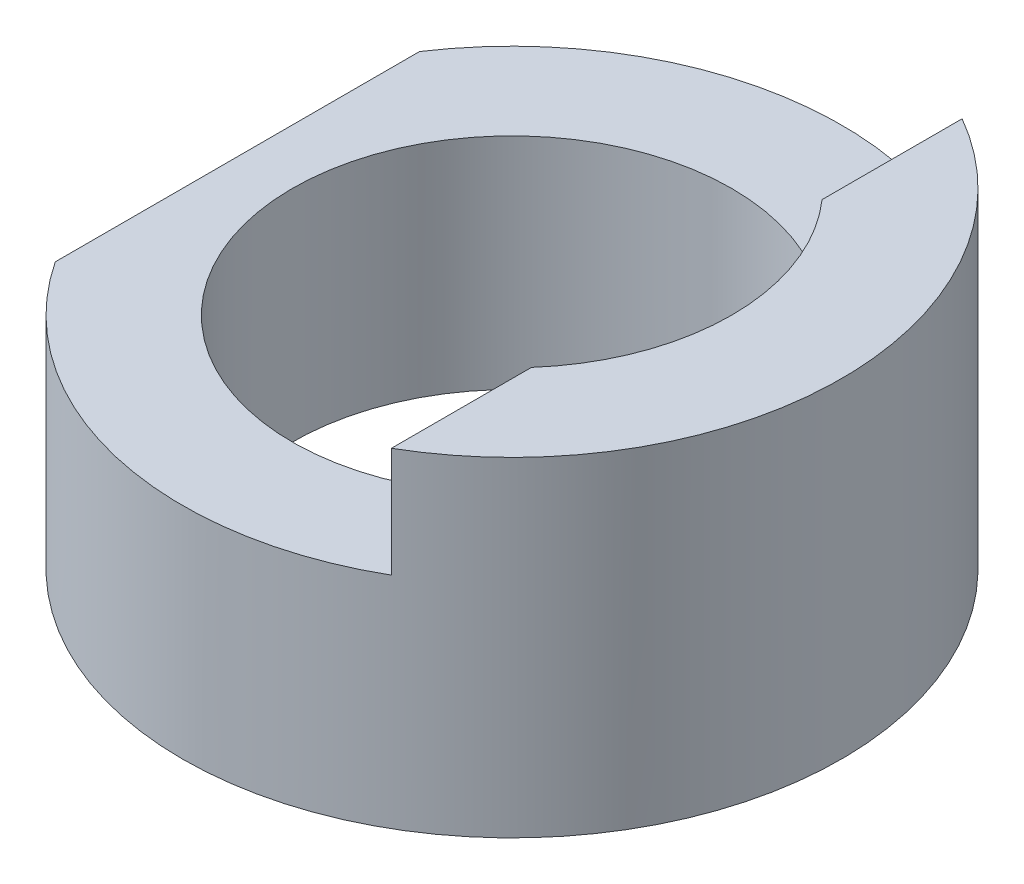
ISO-10303-21;
HEADER;
FILE_DESCRIPTION(('STEP AP214'),'2;1');
FILE_NAME('part.step','',(''),(''),'','','');
FILE_SCHEMA(('AUTOMOTIVE_DESIGN { 1 0 10303 214 1 1 1 1 }'));
ENDSEC;
DATA;
#1=APPLICATION_CONTEXT('core data for automotive mechanical design processes');
#2=APPLICATION_PROTOCOL_DEFINITION('international standard','automotive_design',2000,#1);
#3=PRODUCT_CONTEXT('',#1,'mechanical');
#4=PRODUCT('Part','Part','',(#3));
#5=PRODUCT_RELATED_PRODUCT_CATEGORY('part','',(#4));
#6=PRODUCT_DEFINITION_FORMATION('','',#4);
#7=PRODUCT_DEFINITION_CONTEXT('part definition',#1,'design');
#8=PRODUCT_DEFINITION('design','',#6,#7);
#9=PRODUCT_DEFINITION_SHAPE('','',#8);
#10=(LENGTH_UNIT() NAMED_UNIT(*) SI_UNIT(.MILLI.,.METRE.));
#11=(NAMED_UNIT(*) PLANE_ANGLE_UNIT() SI_UNIT($,.RADIAN.));
#12=(NAMED_UNIT(*) SI_UNIT($,.STERADIAN.) SOLID_ANGLE_UNIT());
#13=UNCERTAINTY_MEASURE_WITH_UNIT(LENGTH_MEASURE(1.E-05),#10,'distance_accuracy_value','');
#14=(GEOMETRIC_REPRESENTATION_CONTEXT(3) GLOBAL_UNCERTAINTY_ASSIGNED_CONTEXT((#13)) GLOBAL_UNIT_ASSIGNED_CONTEXT((#10,
#11,#12)) REPRESENTATION_CONTEXT('',''));
#15=CARTESIAN_POINT('',(0.,0.,0.));
#16=DIRECTION('',(0.,0.,1.));
#17=DIRECTION('',(1.,0.,0.));
#18=AXIS2_PLACEMENT_3D('',#15,#16,#17);
#19=CARTESIAN_POINT('',(90.,0.,0.));
#20=DIRECTION('',(1.,0.,0.));
#21=DIRECTION('',(0.,0.,-1.));
#22=AXIS2_PLACEMENT_3D('',#19,#20,#21);
#23=PLANE('',#22);
#24=DIRECTION('',(0.,0.,1.));
#25=VECTOR('',#24,1.);
#26=CARTESIAN_POINT('',(90.,60.,0.));
#27=LINE('',#26,#25);
#28=CARTESIAN_POINT('',(90.,60.,86.4575131106459));
#29=VERTEX_POINT('',#28);
#30=CARTESIAN_POINT('',(90.,60.,111.961524227066));
#31=VERTEX_POINT('',#30);
#32=EDGE_CURVE('E140',#29,#31,#27,.T.);
#33=ORIENTED_EDGE('',*,*,#32,.F.);
#34=DIRECTION('',(0.,-1.,0.));
#35=VECTOR('',#34,1.);
#36=CARTESIAN_POINT('',(90.,120.,86.4575131106459));
#37=LINE('',#36,#35);
#38=CARTESIAN_POINT('',(90.,40.,86.4575131106459));
#39=VERTEX_POINT('',#38);
#40=EDGE_CURVE('E12',#29,#39,#37,.T.);
#41=ORIENTED_EDGE('',*,*,#40,.T.);
#42=DIRECTION('',(0.,0.,1.));
#43=VECTOR('',#42,1.);
#44=CARTESIAN_POINT('',(90.,40.,0.));
#45=LINE('',#44,#43);
#46=CARTESIAN_POINT('',(90.,40.,111.961524227066));
#47=VERTEX_POINT('',#46);
#48=EDGE_CURVE('E135',#39,#47,#45,.T.);
#49=ORIENTED_EDGE('',*,*,#48,.T.);
#50=DIRECTION('',(0.,-1.,0.));
#51=VECTOR('',#50,1.);
#52=CARTESIAN_POINT('',(90.,120.,111.961524227066));
#53=LINE('',#52,#51);
#54=EDGE_CURVE('E128',#47,#31,#53,.F.);
#55=ORIENTED_EDGE('',*,*,#54,.T.);
#56=EDGE_LOOP('',(#33,#41,#49,#55));
#57=FACE_BOUND('',#56,.T.);
#58=ADVANCED_FACE('F71',(#57),#23,.F.);
#59=CARTESIAN_POINT('',(0.,0.,120.));
#60=DIRECTION('',(0.,1.,0.));
#61=DIRECTION('',(0.,0.,1.));
#62=AXIS2_PLACEMENT_3D('',#59,#60,#61);
#63=PLANE('',#62);
#64=CARTESIAN_POINT('',(60.,0.,60.));
#65=DIRECTION('',(0.,-1.,0.));
#66=DIRECTION('',(0.,0.,-1.));
#67=AXIS2_PLACEMENT_3D('',#64,#65,#66);
#68=CIRCLE('',#67,40.);
#69=CARTESIAN_POINT('',(60.,0.,20.));
#70=VERTEX_POINT('',#69);
#71=EDGE_CURVE('E136',#70,#70,#68,.T.);
#72=ORIENTED_EDGE('',*,*,#71,.F.);
#73=EDGE_LOOP('',(#72));
#74=FACE_BOUND('',#73,.T.);
#75=CARTESIAN_POINT('',(60.,0.,60.));
#76=DIRECTION('',(0.,1.,0.));
#77=DIRECTION('',(0.,0.,1.));
#78=AXIS2_PLACEMENT_3D('',#75,#76,#77);
#79=CIRCLE('',#78,60.);
#80=CARTESIAN_POINT('',(60.,0.,120.));
#81=VERTEX_POINT('',#80);
#82=EDGE_CURVE('E163',#81,#81,#79,.T.);
#83=ORIENTED_EDGE('',*,*,#82,.F.);
#84=EDGE_LOOP('',(#83));
#85=FACE_BOUND('',#84,.T.);
#86=ADVANCED_FACE('F73',(#74,#85),#63,.F.);
#87=CARTESIAN_POINT('',(0.,60.,120.));
#88=DIRECTION('',(0.,-1.,0.));
#89=DIRECTION('',(0.,0.,-1.));
#90=AXIS2_PLACEMENT_3D('',#87,#88,#89);
#91=PLANE('',#90);
#92=CARTESIAN_POINT('',(90.,60.,8.03847577293368));
#93=VERTEX_POINT('',#92);
#94=CARTESIAN_POINT('',(90.,60.,33.5424868893541));
#95=VERTEX_POINT('',#94);
#96=EDGE_CURVE('E142',#93,#95,#27,.T.);
#97=ORIENTED_EDGE('',*,*,#96,.T.);
#98=CARTESIAN_POINT('',(60.,60.,60.));
#99=DIRECTION('',(0.,-1.,0.));
#100=DIRECTION('',(0.,0.,-1.));
#101=AXIS2_PLACEMENT_3D('',#98,#99,#100);
#102=CIRCLE('',#101,40.);
#103=EDGE_CURVE('E86',#95,#29,#102,.T.);
#104=ORIENTED_EDGE('',*,*,#103,.T.);
#105=ORIENTED_EDGE('',*,*,#32,.T.);
#106=CARTESIAN_POINT('',(60.,60.,60.));
#107=DIRECTION('',(0.,-1.,0.));
#108=DIRECTION('',(0.,0.,-1.));
#109=AXIS2_PLACEMENT_3D('',#106,#107,#108);
#110=CIRCLE('',#109,60.);
#111=EDGE_CURVE('E144',#31,#93,#110,.F.);
#112=ORIENTED_EDGE('',*,*,#111,.T.);
#113=EDGE_LOOP('',(#97,#104,#105,#112));
#114=FACE_BOUND('',#113,.T.);
#115=ADVANCED_FACE('F173',(#114),#91,.F.);
#116=CARTESIAN_POINT('',(0.,40.,0.));
#117=DIRECTION('',(0.,-1.,0.));
#118=DIRECTION('',(0.,0.,-1.));
#119=AXIS2_PLACEMENT_3D('',#116,#117,#118);
#120=PLANE('',#119);
#121=ORIENTED_EDGE('',*,*,#48,.F.);
#122=CARTESIAN_POINT('',(60.,40.,60.));
#123=DIRECTION('',(0.,-1.,0.));
#124=DIRECTION('',(0.,0.,-1.));
#125=AXIS2_PLACEMENT_3D('',#122,#123,#124);
#126=CIRCLE('',#125,40.);
#127=CARTESIAN_POINT('',(90.,40.,33.5424868893541));
#128=VERTEX_POINT('',#127);
#129=EDGE_CURVE('E123',#39,#128,#126,.T.);
#130=ORIENTED_EDGE('',*,*,#129,.T.);
#131=CARTESIAN_POINT('',(90.,40.,8.03847577293368));
#132=VERTEX_POINT('',#131);
#133=EDGE_CURVE('E133',#132,#128,#45,.T.);
#134=ORIENTED_EDGE('',*,*,#133,.F.);
#135=CARTESIAN_POINT('',(60.,40.,60.));
#136=DIRECTION('',(0.,-1.,0.));
#137=DIRECTION('',(0.,0.,-1.));
#138=AXIS2_PLACEMENT_3D('',#135,#136,#137);
#139=CIRCLE('',#138,60.);
#140=CARTESIAN_POINT('',(10.,40.,26.833752096446));
#141=VERTEX_POINT('',#140);
#142=EDGE_CURVE('E94',#132,#141,#139,.F.);
#143=ORIENTED_EDGE('',*,*,#142,.T.);
#144=DIRECTION('',(0.,0.,1.));
#145=VECTOR('',#144,1.);
#146=CARTESIAN_POINT('',(10.,40.,0.));
#147=LINE('',#146,#145);
#148=CARTESIAN_POINT('',(10.,40.,93.166247903554));
#149=VERTEX_POINT('',#148);
#150=EDGE_CURVE('E149',#141,#149,#147,.T.);
#151=ORIENTED_EDGE('',*,*,#150,.T.);
#152=CARTESIAN_POINT('',(60.,40.,60.));
#153=DIRECTION('',(0.,-1.,0.));
#154=DIRECTION('',(0.,0.,-1.));
#155=AXIS2_PLACEMENT_3D('',#152,#153,#154);
#156=CIRCLE('',#155,60.);
#157=EDGE_CURVE('E158',#149,#47,#156,.F.);
#158=ORIENTED_EDGE('',*,*,#157,.T.);
#159=EDGE_LOOP('',(#121,#130,#134,#143,#151,#158));
#160=FACE_BOUND('',#159,.T.);
#161=ADVANCED_FACE('F132',(#160),#120,.F.);
#162=CARTESIAN_POINT('',(10.,0.,0.));
#163=DIRECTION('',(1.,0.,0.));
#164=DIRECTION('',(0.,0.,-1.));
#165=AXIS2_PLACEMENT_3D('',#162,#163,#164);
#166=PLANE('',#165);
#167=DIRECTION('',(0.,0.,1.));
#168=VECTOR('',#167,1.);
#169=CARTESIAN_POINT('',(10.,20.,0.));
#170=LINE('',#169,#168);
#171=CARTESIAN_POINT('',(10.,20.,26.833752096446));
#172=VERTEX_POINT('',#171);
#173=CARTESIAN_POINT('',(10.,20.,93.166247903554));
#174=VERTEX_POINT('',#173);
#175=EDGE_CURVE('E168',#172,#174,#170,.T.);
#176=ORIENTED_EDGE('',*,*,#175,.T.);
#177=DIRECTION('',(0.,-1.,0.));
#178=VECTOR('',#177,1.);
#179=CARTESIAN_POINT('',(10.,120.,93.166247903554));
#180=LINE('',#179,#178);
#181=EDGE_CURVE('E174',#174,#149,#180,.F.);
#182=ORIENTED_EDGE('',*,*,#181,.T.);
#183=ORIENTED_EDGE('',*,*,#150,.F.);
#184=DIRECTION('',(0.,-1.,0.));
#185=VECTOR('',#184,1.);
#186=CARTESIAN_POINT('',(10.,120.,26.833752096446));
#187=LINE('',#186,#185);
#188=EDGE_CURVE('E180',#141,#172,#187,.T.);
#189=ORIENTED_EDGE('',*,*,#188,.T.);
#190=EDGE_LOOP('',(#176,#182,#183,#189));
#191=FACE_BOUND('',#190,.T.);
#192=ADVANCED_FACE('F202',(#191),#166,.F.);
#193=CARTESIAN_POINT('',(0.,20.,0.));
#194=DIRECTION('',(0.,-1.,0.));
#195=DIRECTION('',(0.,0.,-1.));
#196=AXIS2_PLACEMENT_3D('',#193,#194,#195);
#197=PLANE('',#196);
#198=CARTESIAN_POINT('',(60.,20.,60.));
#199=DIRECTION('',(0.,-1.,0.));
#200=DIRECTION('',(0.,0.,-1.));
#201=AXIS2_PLACEMENT_3D('',#198,#199,#200);
#202=CIRCLE('',#201,60.);
#203=EDGE_CURVE('E148',#172,#174,#202,.F.);
#204=ORIENTED_EDGE('',*,*,#203,.T.);
#205=ORIENTED_EDGE('',*,*,#175,.F.);
#206=EDGE_LOOP('',(#204,#205));
#207=FACE_BOUND('',#206,.T.);
#208=ADVANCED_FACE('F205',(#207),#197,.F.);
#209=ORIENTED_EDGE('',*,*,#133,.T.);
#210=DIRECTION('',(0.,-1.,0.));
#211=VECTOR('',#210,1.);
#212=CARTESIAN_POINT('',(90.,120.,33.5424868893541));
#213=LINE('',#212,#211);
#214=EDGE_CURVE('E79',#128,#95,#213,.F.);
#215=ORIENTED_EDGE('',*,*,#214,.T.);
#216=ORIENTED_EDGE('',*,*,#96,.F.);
#217=DIRECTION('',(0.,-1.,0.));
#218=VECTOR('',#217,1.);
#219=CARTESIAN_POINT('',(90.,120.,8.03847577293368));
#220=LINE('',#219,#218);
#221=EDGE_CURVE('E139',#93,#132,#220,.T.);
#222=ORIENTED_EDGE('',*,*,#221,.T.);
#223=EDGE_LOOP('',(#209,#215,#216,#222));
#224=FACE_BOUND('',#223,.T.);
#225=ADVANCED_FACE('F138',(#224),#23,.F.);
#226=CARTESIAN_POINT('',(60.,120.,60.));
#227=DIRECTION('',(0.,-1.,0.));
#228=DIRECTION('',(0.,0.,-1.));
#229=AXIS2_PLACEMENT_3D('',#226,#227,#228);
#230=CYLINDRICAL_SURFACE('',#229,60.);
#231=ORIENTED_EDGE('',*,*,#82,.T.);
#232=EDGE_LOOP('',(#231));
#233=FACE_BOUND('',#232,.T.);
#234=ORIENTED_EDGE('',*,*,#111,.F.);
#235=ORIENTED_EDGE('',*,*,#54,.F.);
#236=ORIENTED_EDGE('',*,*,#157,.F.);
#237=ORIENTED_EDGE('',*,*,#181,.F.);
#238=ORIENTED_EDGE('',*,*,#203,.F.);
#239=ORIENTED_EDGE('',*,*,#188,.F.);
#240=ORIENTED_EDGE('',*,*,#142,.F.);
#241=ORIENTED_EDGE('',*,*,#221,.F.);
#242=EDGE_LOOP('',(#234,#235,#236,#237,#238,#239,#240,#241));
#243=FACE_BOUND('',#242,.T.);
#244=ADVANCED_FACE('F156',(#233,#243),#230,.T.);
#245=CARTESIAN_POINT('',(60.,120.,60.));
#246=DIRECTION('',(0.,-1.,0.));
#247=DIRECTION('',(0.,0.,-1.));
#248=AXIS2_PLACEMENT_3D('',#245,#246,#247);
#249=CYLINDRICAL_SURFACE('',#248,40.);
#250=ORIENTED_EDGE('',*,*,#71,.T.);
#251=EDGE_LOOP('',(#250));
#252=FACE_BOUND('',#251,.T.);
#253=ORIENTED_EDGE('',*,*,#103,.F.);
#254=ORIENTED_EDGE('',*,*,#214,.F.);
#255=ORIENTED_EDGE('',*,*,#129,.F.);
#256=ORIENTED_EDGE('',*,*,#40,.F.);
#257=EDGE_LOOP('',(#253,#254,#255,#256));
#258=FACE_BOUND('',#257,.T.);
#259=ADVANCED_FACE('F122',(#252,#258),#249,.F.);
#260=CLOSED_SHELL('',(#58,#86,#115,#161,#192,#208,#225,#244,#259));
#261=MANIFOLD_SOLID_BREP('B2',#260);
#262=ADVANCED_BREP_SHAPE_REPRESENTATION('',(#18,#261),#14);
#263=SHAPE_DEFINITION_REPRESENTATION(#9,#262);
ENDSEC;
END-ISO-10303-21;
